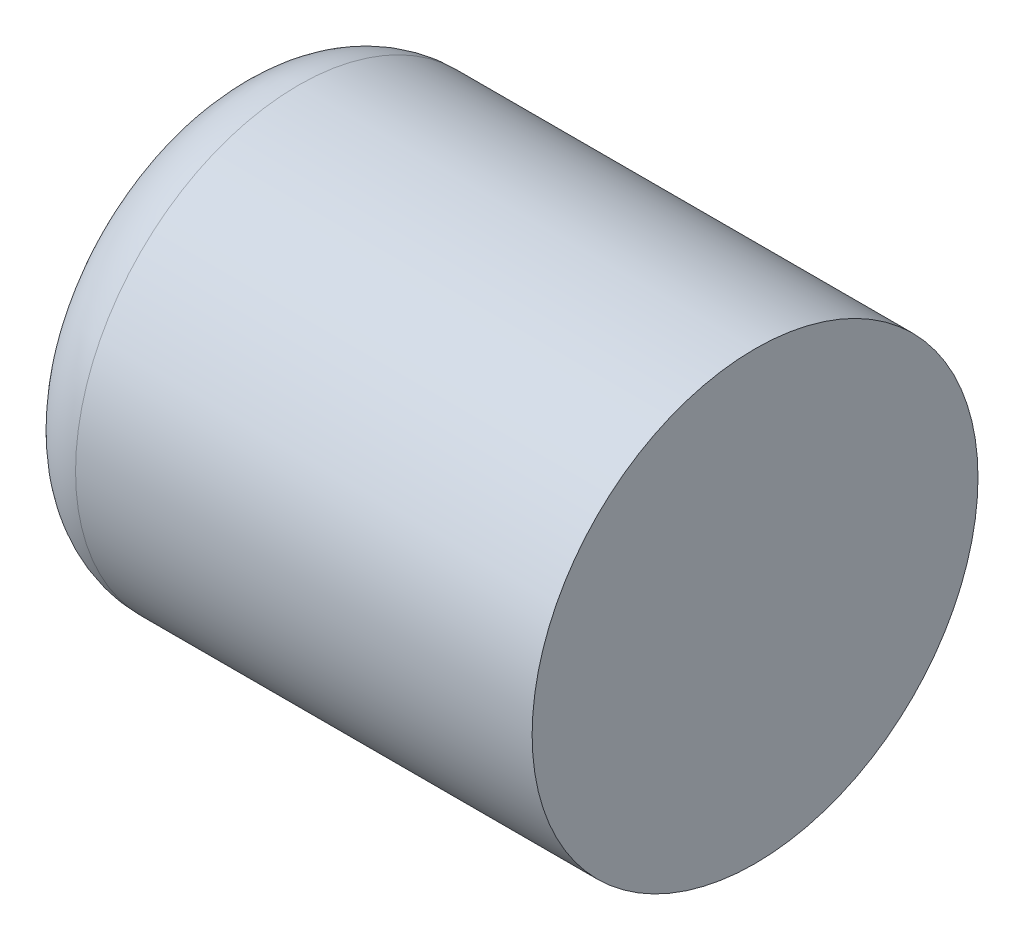
ISO-10303-21;
HEADER;
FILE_DESCRIPTION(('STEP AP214'),'2;1');
FILE_NAME('part.step','',(''),(''),'','','');
FILE_SCHEMA(('AUTOMOTIVE_DESIGN { 1 0 10303 214 1 1 1 1 }'));
ENDSEC;
DATA;
#1=APPLICATION_CONTEXT('core data for automotive mechanical design processes');
#2=APPLICATION_PROTOCOL_DEFINITION('international standard','automotive_design',2000,#1);
#3=PRODUCT_CONTEXT('',#1,'mechanical');
#4=PRODUCT('Part','Part','',(#3));
#5=PRODUCT_RELATED_PRODUCT_CATEGORY('part','',(#4));
#6=PRODUCT_DEFINITION_FORMATION('','',#4);
#7=PRODUCT_DEFINITION_CONTEXT('part definition',#1,'design');
#8=PRODUCT_DEFINITION('design','',#6,#7);
#9=PRODUCT_DEFINITION_SHAPE('','',#8);
#10=(LENGTH_UNIT() NAMED_UNIT(*) SI_UNIT(.MILLI.,.METRE.));
#11=(NAMED_UNIT(*) PLANE_ANGLE_UNIT() SI_UNIT($,.RADIAN.));
#12=(NAMED_UNIT(*) SI_UNIT($,.STERADIAN.) SOLID_ANGLE_UNIT());
#13=UNCERTAINTY_MEASURE_WITH_UNIT(LENGTH_MEASURE(1.E-05),#10,'distance_accuracy_value','');
#14=(GEOMETRIC_REPRESENTATION_CONTEXT(3) GLOBAL_UNCERTAINTY_ASSIGNED_CONTEXT((#13)) GLOBAL_UNIT_ASSIGNED_CONTEXT((#10,
#11,#12)) REPRESENTATION_CONTEXT('',''));
#15=CARTESIAN_POINT('',(0.,0.,0.));
#16=DIRECTION('',(0.,0.,1.));
#17=DIRECTION('',(1.,0.,0.));
#18=AXIS2_PLACEMENT_3D('',#15,#16,#17);
#19=CARTESIAN_POINT('',(0.975635714690617,-0.332340218761648,0.1012));
#20=DIRECTION('',(1.,0.,0.));
#21=DIRECTION('',(0.,1.,0.));
#22=AXIS2_PLACEMENT_3D('',#19,#20,#21);
#23=PLANE('',#22);
#24=CARTESIAN_POINT('',(0.975635714690616,-0.332340218761648,0.1012));
#25=DIRECTION('',(1.,0.,0.));
#26=DIRECTION('',(0.,0.,-1.));
#27=AXIS2_PLACEMENT_3D('',#24,#25,#26);
#28=CIRCLE('',#27,0.0212499999999999);
#29=CARTESIAN_POINT('',(0.975635714690616,-0.332340218761648,0.0799500000000001));
#30=VERTEX_POINT('',#29);
#31=CARTESIAN_POINT('',(0.975635714690617,-0.311090218761648,0.1012));
#32=VERTEX_POINT('',#31);
#33=EDGE_CURVE('E35',#30,#32,#28,.T.);
#34=ORIENTED_EDGE('',*,*,#33,.F.);
#35=CARTESIAN_POINT('',(0.975635714690616,-0.332340218761648,0.1012));
#36=DIRECTION('',(1.,0.,0.));
#37=DIRECTION('',(0.,0.,1.));
#38=AXIS2_PLACEMENT_3D('',#35,#36,#37);
#39=CIRCLE('',#38,0.02125);
#40=CARTESIAN_POINT('',(0.975635714690616,-0.332340218761648,0.12245));
#41=VERTEX_POINT('',#40);
#42=EDGE_CURVE('E44',#41,#30,#39,.T.);
#43=ORIENTED_EDGE('',*,*,#42,.F.);
#44=CARTESIAN_POINT('',(0.975635714690616,-0.332340218761648,0.1012));
#45=DIRECTION('',(1.,0.,0.));
#46=DIRECTION('',(0.,1.,0.));
#47=AXIS2_PLACEMENT_3D('',#44,#45,#46);
#48=CIRCLE('',#47,0.02125);
#49=EDGE_CURVE('E42',#32,#41,#48,.T.);
#50=ORIENTED_EDGE('',*,*,#49,.F.);
#51=EDGE_LOOP('',(#34,#43,#50));
#52=FACE_BOUND('',#51,.T.);
#53=ADVANCED_FACE('F17',(#52),#23,.F.);
#54=CARTESIAN_POINT('',(0.985635714690616,-0.332340218761648,0.1012));
#55=DIRECTION('',(1.,0.,0.));
#56=DIRECTION('',(0.,0.,1.));
#57=AXIS2_PLACEMENT_3D('',#54,#55,#56);
#58=TOROIDAL_SURFACE('',#57,0.02125,0.01);
#59=ORIENTED_EDGE('',*,*,#49,.T.);
#60=ORIENTED_EDGE('',*,*,#42,.T.);
#61=ORIENTED_EDGE('',*,*,#33,.T.);
#62=EDGE_LOOP('',(#59,#60,#61));
#63=FACE_BOUND('',#62,.T.);
#64=CARTESIAN_POINT('',(0.985635714690616,-0.332340218761648,0.1012));
#65=DIRECTION('',(1.,0.,0.));
#66=DIRECTION('',(0.,1.,0.));
#67=AXIS2_PLACEMENT_3D('',#64,#65,#66);
#68=CIRCLE('',#67,0.03125);
#69=CARTESIAN_POINT('',(0.985635714690616,-0.301090218761648,0.1012));
#70=VERTEX_POINT('',#69);
#71=EDGE_CURVE('E27',#70,#70,#68,.T.);
#72=ORIENTED_EDGE('',*,*,#71,.F.);
#73=EDGE_LOOP('',(#72));
#74=FACE_BOUND('',#73,.T.);
#75=ADVANCED_FACE('F49',(#63,#74),#58,.T.);
#76=CARTESIAN_POINT('',(1.04963571469062,-0.332340218761648,0.1012));
#77=DIRECTION('',(-1.,0.,0.));
#78=DIRECTION('',(0.,-1.,0.));
#79=AXIS2_PLACEMENT_3D('',#76,#77,#78);
#80=PLANE('',#79);
#81=CARTESIAN_POINT('',(1.04963571469062,-0.332340218761648,0.1012));
#82=DIRECTION('',(1.,0.,0.));
#83=DIRECTION('',(0.,1.,0.));
#84=AXIS2_PLACEMENT_3D('',#81,#82,#83);
#85=CIRCLE('',#84,0.03125);
#86=CARTESIAN_POINT('',(1.04963571469062,-0.301090218761648,0.1012));
#87=VERTEX_POINT('',#86);
#88=EDGE_CURVE('E11',#87,#87,#85,.F.);
#89=ORIENTED_EDGE('',*,*,#88,.F.);
#90=EDGE_LOOP('',(#89));
#91=FACE_BOUND('',#90,.T.);
#92=ADVANCED_FACE('F65',(#91),#80,.F.);
#93=CARTESIAN_POINT('',(1.07963571469062,-0.332340218761648,0.1012));
#94=DIRECTION('',(1.,0.,0.));
#95=DIRECTION('',(0.,1.,0.));
#96=AXIS2_PLACEMENT_3D('',#93,#94,#95);
#97=CYLINDRICAL_SURFACE('',#96,0.03125);
#98=ORIENTED_EDGE('',*,*,#71,.T.);
#99=EDGE_LOOP('',(#98));
#100=FACE_BOUND('',#99,.T.);
#101=ORIENTED_EDGE('',*,*,#88,.T.);
#102=EDGE_LOOP('',(#101));
#103=FACE_BOUND('',#102,.T.);
#104=ADVANCED_FACE('F89',(#100,#103),#97,.T.);
#105=CLOSED_SHELL('',(#53,#75,#92,#104));
#106=MANIFOLD_SOLID_BREP('B1',#105);
#107=ADVANCED_BREP_SHAPE_REPRESENTATION('',(#18,#106),#14);
#108=SHAPE_DEFINITION_REPRESENTATION(#9,#107);
ENDSEC;
END-ISO-10303-21;
